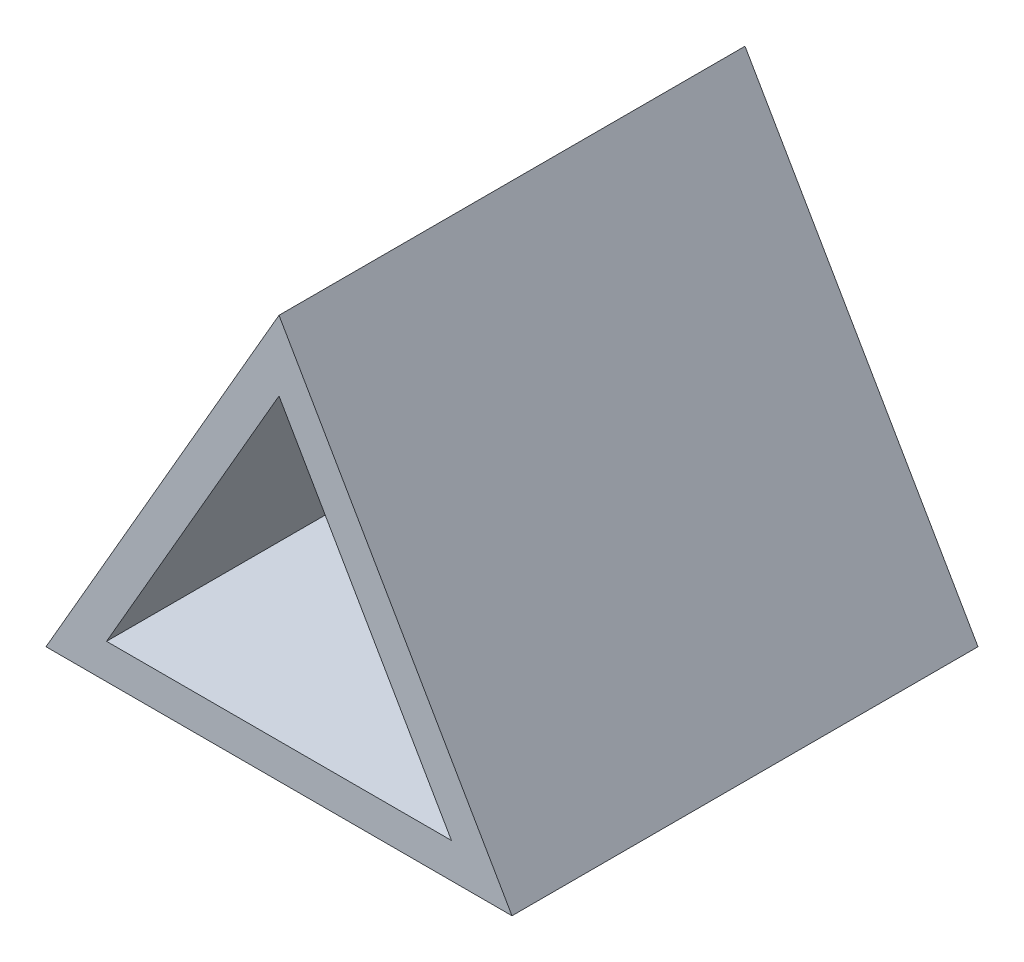
ISO-10303-21;
HEADER;
FILE_DESCRIPTION(('STEP AP214'),'2;1');
FILE_NAME('part.step','',(''),(''),'','','');
FILE_SCHEMA(('AUTOMOTIVE_DESIGN { 1 0 10303 214 1 1 1 1 }'));
ENDSEC;
DATA;
#1=APPLICATION_CONTEXT('core data for automotive mechanical design processes');
#2=APPLICATION_PROTOCOL_DEFINITION('international standard','automotive_design',2000,#1);
#3=PRODUCT_CONTEXT('',#1,'mechanical');
#4=PRODUCT('Part','Part','',(#3));
#5=PRODUCT_RELATED_PRODUCT_CATEGORY('part','',(#4));
#6=PRODUCT_DEFINITION_FORMATION('','',#4);
#7=PRODUCT_DEFINITION_CONTEXT('part definition',#1,'design');
#8=PRODUCT_DEFINITION('design','',#6,#7);
#9=PRODUCT_DEFINITION_SHAPE('','',#8);
#10=(LENGTH_UNIT() NAMED_UNIT(*) SI_UNIT(.MILLI.,.METRE.));
#11=(NAMED_UNIT(*) PLANE_ANGLE_UNIT() SI_UNIT($,.RADIAN.));
#12=(NAMED_UNIT(*) SI_UNIT($,.STERADIAN.) SOLID_ANGLE_UNIT());
#13=UNCERTAINTY_MEASURE_WITH_UNIT(LENGTH_MEASURE(1.E-05),#10,'distance_accuracy_value','');
#14=(GEOMETRIC_REPRESENTATION_CONTEXT(3) GLOBAL_UNCERTAINTY_ASSIGNED_CONTEXT((#13)) GLOBAL_UNIT_ASSIGNED_CONTEXT((#10,
#11,#12)) REPRESENTATION_CONTEXT('',''));
#15=CARTESIAN_POINT('',(0.,0.,0.));
#16=DIRECTION('',(0.,0.,1.));
#17=DIRECTION('',(1.,0.,0.));
#18=AXIS2_PLACEMENT_3D('',#15,#16,#17);
#19=CARTESIAN_POINT('',(29.5633820944066,8.86759909038839,40.));
#20=DIRECTION('',(-0.866025403784436,-0.500000000000004,0.));
#21=DIRECTION('',(0.500000000000004,-0.866025403784436,0.));
#22=AXIS2_PLACEMENT_3D('',#19,#20,#21);
#23=PLANE('',#22);
#24=DIRECTION('',(-0.500000000000004,0.866025403784436,0.));
#25=VECTOR('',#24,1.);
#26=CARTESIAN_POINT('',(29.5633820944066,8.86759909038839,0.));
#27=LINE('',#26,#25);
#28=CARTESIAN_POINT('',(29.5633820944066,8.86759909038839,0.));
#29=VERTEX_POINT('',#28);
#30=CARTESIAN_POINT('',(9.56338209440642,43.5086152417658,0.));
#31=VERTEX_POINT('',#30);
#32=EDGE_CURVE('E143',#29,#31,#27,.T.);
#33=ORIENTED_EDGE('',*,*,#32,.T.);
#34=DIRECTION('',(0.,0.,-1.));
#35=VECTOR('',#34,1.);
#36=CARTESIAN_POINT('',(9.56338209440642,43.5086152417658,40.));
#37=LINE('',#36,#35);
#38=CARTESIAN_POINT('',(9.56338209440642,43.5086152417658,40.));
#39=VERTEX_POINT('',#38);
#40=EDGE_CURVE('E11',#39,#31,#37,.T.);
#41=ORIENTED_EDGE('',*,*,#40,.F.);
#42=DIRECTION('',(-0.500000000000004,0.866025403784436,0.));
#43=VECTOR('',#42,1.);
#44=CARTESIAN_POINT('',(29.5633820944066,8.86759909038839,40.));
#45=LINE('',#44,#43);
#46=CARTESIAN_POINT('',(29.5633820944066,8.86759909038839,40.));
#47=VERTEX_POINT('',#46);
#48=EDGE_CURVE('E146',#47,#39,#45,.T.);
#49=ORIENTED_EDGE('',*,*,#48,.F.);
#50=DIRECTION('',(0.,0.,-1.));
#51=VECTOR('',#50,1.);
#52=CARTESIAN_POINT('',(29.5633820944066,8.86759909038839,40.));
#53=LINE('',#52,#51);
#54=EDGE_CURVE('E153',#47,#29,#53,.T.);
#55=ORIENTED_EDGE('',*,*,#54,.T.);
#56=EDGE_LOOP('',(#33,#41,#49,#55));
#57=FACE_BOUND('',#56,.T.);
#58=ADVANCED_FACE('F45',(#57),#23,.F.);
#59=CARTESIAN_POINT('',(9.56338209440642,43.5086152417658,40.));
#60=DIRECTION('',(0.866025403784436,-0.500000000000004,0.));
#61=DIRECTION('',(0.500000000000004,0.866025403784436,0.));
#62=AXIS2_PLACEMENT_3D('',#59,#60,#61);
#63=PLANE('',#62);
#64=DIRECTION('',(-0.500000000000004,-0.866025403784436,0.));
#65=VECTOR('',#64,1.);
#66=CARTESIAN_POINT('',(9.56338209440642,43.5086152417658,0.));
#67=LINE('',#66,#65);
#68=CARTESIAN_POINT('',(-10.4366179055937,8.86759909038839,0.));
#69=VERTEX_POINT('',#68);
#70=EDGE_CURVE('E157',#31,#69,#67,.T.);
#71=ORIENTED_EDGE('',*,*,#70,.T.);
#72=DIRECTION('',(0.,0.,-1.));
#73=VECTOR('',#72,1.);
#74=CARTESIAN_POINT('',(-10.4366179055937,8.86759909038839,40.));
#75=LINE('',#74,#73);
#76=CARTESIAN_POINT('',(-10.4366179055937,8.86759909038839,40.));
#77=VERTEX_POINT('',#76);
#78=EDGE_CURVE('E53',#77,#69,#75,.T.);
#79=ORIENTED_EDGE('',*,*,#78,.F.);
#80=DIRECTION('',(-0.500000000000004,-0.866025403784436,0.));
#81=VECTOR('',#80,1.);
#82=CARTESIAN_POINT('',(9.56338209440642,43.5086152417658,40.));
#83=LINE('',#82,#81);
#84=EDGE_CURVE('E91',#39,#77,#83,.T.);
#85=ORIENTED_EDGE('',*,*,#84,.F.);
#86=ORIENTED_EDGE('',*,*,#40,.T.);
#87=EDGE_LOOP('',(#71,#79,#85,#86));
#88=FACE_BOUND('',#87,.T.);
#89=ADVANCED_FACE('F181',(#88),#63,.F.);
#90=CARTESIAN_POINT('',(-10.4366179055937,8.86759909038839,40.));
#91=DIRECTION('',(0.,1.,0.));
#92=DIRECTION('',(0.,0.,1.));
#93=AXIS2_PLACEMENT_3D('',#90,#91,#92);
#94=PLANE('',#93);
#95=DIRECTION('',(1.,0.,0.));
#96=VECTOR('',#95,1.);
#97=CARTESIAN_POINT('',(-10.4366179055937,8.86759909038839,0.));
#98=LINE('',#97,#96);
#99=EDGE_CURVE('E86',#69,#29,#98,.T.);
#100=ORIENTED_EDGE('',*,*,#99,.T.);
#101=ORIENTED_EDGE('',*,*,#54,.F.);
#102=DIRECTION('',(1.,0.,0.));
#103=VECTOR('',#102,1.);
#104=CARTESIAN_POINT('',(-10.4366179055937,8.86759909038839,40.));
#105=LINE('',#104,#103);
#106=EDGE_CURVE('E69',#77,#47,#105,.T.);
#107=ORIENTED_EDGE('',*,*,#106,.F.);
#108=ORIENTED_EDGE('',*,*,#78,.T.);
#109=EDGE_LOOP('',(#100,#101,#107,#108));
#110=FACE_BOUND('',#109,.T.);
#111=ADVANCED_FACE('F164',(#110),#94,.F.);
#112=CARTESIAN_POINT('',(0.,0.,40.));
#113=DIRECTION('',(0.,0.,1.));
#114=DIRECTION('',(1.,0.,0.));
#115=AXIS2_PLACEMENT_3D('',#112,#113,#114);
#116=PLANE('',#115);
#117=DIRECTION('',(-0.500000000000004,0.866025403784436,0.));
#118=VECTOR('',#117,1.);
#119=CARTESIAN_POINT('',(24.3672296716999,11.8675990903884,40.));
#120=LINE('',#119,#118);
#121=CARTESIAN_POINT('',(24.3672296716999,11.8675990903884,40.));
#122=VERTEX_POINT('',#121);
#123=CARTESIAN_POINT('',(9.56338209440643,37.5086152417659,40.));
#124=VERTEX_POINT('',#123);
#125=EDGE_CURVE('E60',#122,#124,#120,.T.);
#126=ORIENTED_EDGE('',*,*,#125,.F.);
#127=DIRECTION('',(1.,0.,0.));
#128=VECTOR('',#127,1.);
#129=CARTESIAN_POINT('',(-5.24046548288707,11.8675990903884,40.));
#130=LINE('',#129,#128);
#131=CARTESIAN_POINT('',(-5.24046548288707,11.8675990903884,40.));
#132=VERTEX_POINT('',#131);
#133=EDGE_CURVE('E127',#132,#122,#130,.T.);
#134=ORIENTED_EDGE('',*,*,#133,.F.);
#135=DIRECTION('',(-0.500000000000004,-0.866025403784436,0.));
#136=VECTOR('',#135,1.);
#137=CARTESIAN_POINT('',(9.56338209440643,37.5086152417659,40.));
#138=LINE('',#137,#136);
#139=EDGE_CURVE('E131',#124,#132,#138,.T.);
#140=ORIENTED_EDGE('',*,*,#139,.F.);
#141=EDGE_LOOP('',(#126,#134,#140));
#142=FACE_BOUND('',#141,.T.);
#143=ORIENTED_EDGE('',*,*,#48,.T.);
#144=ORIENTED_EDGE('',*,*,#84,.T.);
#145=ORIENTED_EDGE('',*,*,#106,.T.);
#146=EDGE_LOOP('',(#143,#144,#145));
#147=FACE_BOUND('',#146,.T.);
#148=ADVANCED_FACE('F171',(#142,#147),#116,.T.);
#149=CARTESIAN_POINT('',(0.,0.,0.));
#150=DIRECTION('',(0.,0.,1.));
#151=DIRECTION('',(1.,0.,0.));
#152=AXIS2_PLACEMENT_3D('',#149,#150,#151);
#153=PLANE('',#152);
#154=ORIENTED_EDGE('',*,*,#32,.F.);
#155=ORIENTED_EDGE('',*,*,#99,.F.);
#156=ORIENTED_EDGE('',*,*,#70,.F.);
#157=EDGE_LOOP('',(#154,#155,#156));
#158=FACE_BOUND('',#157,.T.);
#159=ADVANCED_FACE('F167',(#158),#153,.F.);
#160=CARTESIAN_POINT('',(24.3672296716999,11.8675990903884,3.));
#161=DIRECTION('',(0.866025403784436,0.500000000000004,0.));
#162=DIRECTION('',(-0.500000000000004,0.866025403784436,0.));
#163=AXIS2_PLACEMENT_3D('',#160,#161,#162);
#164=PLANE('',#163);
#165=ORIENTED_EDGE('',*,*,#125,.T.);
#166=DIRECTION('',(0.,0.,1.));
#167=VECTOR('',#166,1.);
#168=CARTESIAN_POINT('',(9.56338209440643,37.5086152417659,3.));
#169=LINE('',#168,#167);
#170=CARTESIAN_POINT('',(9.56338209440643,37.5086152417659,3.));
#171=VERTEX_POINT('',#170);
#172=EDGE_CURVE('E105',#171,#124,#169,.T.);
#173=ORIENTED_EDGE('',*,*,#172,.F.);
#174=DIRECTION('',(-0.500000000000004,0.866025403784436,0.));
#175=VECTOR('',#174,1.);
#176=CARTESIAN_POINT('',(24.3672296716999,11.8675990903884,3.));
#177=LINE('',#176,#175);
#178=CARTESIAN_POINT('',(24.3672296716999,11.8675990903884,3.));
#179=VERTEX_POINT('',#178);
#180=EDGE_CURVE('E109',#179,#171,#177,.T.);
#181=ORIENTED_EDGE('',*,*,#180,.F.);
#182=DIRECTION('',(0.,0.,1.));
#183=VECTOR('',#182,1.);
#184=CARTESIAN_POINT('',(24.3672296716999,11.8675990903884,3.));
#185=LINE('',#184,#183);
#186=EDGE_CURVE('E140',#179,#122,#185,.T.);
#187=ORIENTED_EDGE('',*,*,#186,.T.);
#188=EDGE_LOOP('',(#165,#173,#181,#187));
#189=FACE_BOUND('',#188,.T.);
#190=ADVANCED_FACE('F107',(#189),#164,.F.);
#191=CARTESIAN_POINT('',(-5.24046548288707,11.8675990903884,3.));
#192=DIRECTION('',(0.,-1.,0.));
#193=DIRECTION('',(0.,0.,-1.));
#194=AXIS2_PLACEMENT_3D('',#191,#192,#193);
#195=PLANE('',#194);
#196=ORIENTED_EDGE('',*,*,#133,.T.);
#197=ORIENTED_EDGE('',*,*,#186,.F.);
#198=DIRECTION('',(1.,0.,0.));
#199=VECTOR('',#198,1.);
#200=CARTESIAN_POINT('',(-5.24046548288707,11.8675990903884,3.));
#201=LINE('',#200,#199);
#202=CARTESIAN_POINT('',(-5.24046548288707,11.8675990903884,3.));
#203=VERTEX_POINT('',#202);
#204=EDGE_CURVE('E116',#203,#179,#201,.T.);
#205=ORIENTED_EDGE('',*,*,#204,.F.);
#206=DIRECTION('',(0.,0.,1.));
#207=VECTOR('',#206,1.);
#208=CARTESIAN_POINT('',(-5.24046548288707,11.8675990903884,3.));
#209=LINE('',#208,#207);
#210=EDGE_CURVE('E115',#203,#132,#209,.T.);
#211=ORIENTED_EDGE('',*,*,#210,.T.);
#212=EDGE_LOOP('',(#196,#197,#205,#211));
#213=FACE_BOUND('',#212,.T.);
#214=ADVANCED_FACE('F212',(#213),#195,.F.);
#215=CARTESIAN_POINT('',(9.56338209440643,37.5086152417659,3.));
#216=DIRECTION('',(-0.866025403784436,0.500000000000004,0.));
#217=DIRECTION('',(-0.500000000000004,-0.866025403784436,0.));
#218=AXIS2_PLACEMENT_3D('',#215,#216,#217);
#219=PLANE('',#218);
#220=ORIENTED_EDGE('',*,*,#139,.T.);
#221=ORIENTED_EDGE('',*,*,#210,.F.);
#222=DIRECTION('',(-0.500000000000004,-0.866025403784436,0.));
#223=VECTOR('',#222,1.);
#224=CARTESIAN_POINT('',(9.56338209440643,37.5086152417659,3.));
#225=LINE('',#224,#223);
#226=EDGE_CURVE('E119',#171,#203,#225,.T.);
#227=ORIENTED_EDGE('',*,*,#226,.F.);
#228=ORIENTED_EDGE('',*,*,#172,.T.);
#229=EDGE_LOOP('',(#220,#221,#227,#228));
#230=FACE_BOUND('',#229,.T.);
#231=ADVANCED_FACE('F120',(#230),#219,.F.);
#232=CARTESIAN_POINT('',(0.,0.,3.));
#233=DIRECTION('',(0.,0.,1.));
#234=DIRECTION('',(1.,0.,0.));
#235=AXIS2_PLACEMENT_3D('',#232,#233,#234);
#236=PLANE('',#235);
#237=ORIENTED_EDGE('',*,*,#180,.T.);
#238=ORIENTED_EDGE('',*,*,#226,.T.);
#239=ORIENTED_EDGE('',*,*,#204,.T.);
#240=EDGE_LOOP('',(#237,#238,#239));
#241=FACE_BOUND('',#240,.T.);
#242=ADVANCED_FACE('F125',(#241),#236,.T.);
#243=CLOSED_SHELL('',(#58,#89,#111,#148,#159,#190,#214,#231,#242));
#244=MANIFOLD_SOLID_BREP('B2',#243);
#245=ADVANCED_BREP_SHAPE_REPRESENTATION('',(#18,#244),#14);
#246=SHAPE_DEFINITION_REPRESENTATION(#9,#245);
ENDSEC;
END-ISO-10303-21;
